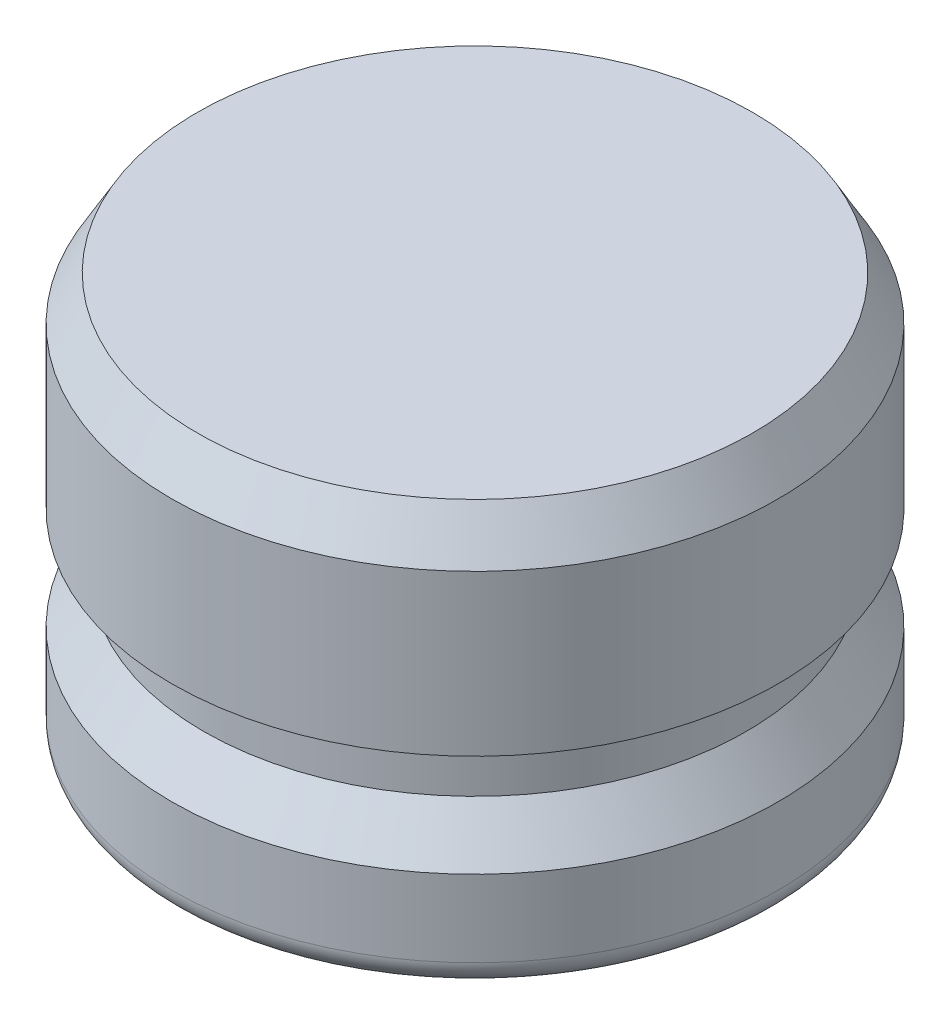
ISO-10303-21;
HEADER;
FILE_DESCRIPTION(('STEP AP214'),'2;1');
FILE_NAME('part.step','',(''),(''),'','','');
FILE_SCHEMA(('AUTOMOTIVE_DESIGN { 1 0 10303 214 1 1 1 1 }'));
ENDSEC;
DATA;
#1=APPLICATION_CONTEXT('core data for automotive mechanical design processes');
#2=APPLICATION_PROTOCOL_DEFINITION('international standard','automotive_design',2000,#1);
#3=PRODUCT_CONTEXT('',#1,'mechanical');
#4=PRODUCT('Part','Part','',(#3));
#5=PRODUCT_RELATED_PRODUCT_CATEGORY('part','',(#4));
#6=PRODUCT_DEFINITION_FORMATION('','',#4);
#7=PRODUCT_DEFINITION_CONTEXT('part definition',#1,'design');
#8=PRODUCT_DEFINITION('design','',#6,#7);
#9=PRODUCT_DEFINITION_SHAPE('','',#8);
#10=(LENGTH_UNIT() NAMED_UNIT(*) SI_UNIT(.MILLI.,.METRE.));
#11=(NAMED_UNIT(*) PLANE_ANGLE_UNIT() SI_UNIT($,.RADIAN.));
#12=(NAMED_UNIT(*) SI_UNIT($,.STERADIAN.) SOLID_ANGLE_UNIT());
#13=UNCERTAINTY_MEASURE_WITH_UNIT(LENGTH_MEASURE(1.E-05),#10,'distance_accuracy_value','');
#14=(GEOMETRIC_REPRESENTATION_CONTEXT(3) GLOBAL_UNCERTAINTY_ASSIGNED_CONTEXT((#13)) GLOBAL_UNIT_ASSIGNED_CONTEXT((#10,
#11,#12)) REPRESENTATION_CONTEXT('',''));
#15=CARTESIAN_POINT('',(0.,0.,0.));
#16=DIRECTION('',(0.,0.,1.));
#17=DIRECTION('',(1.,0.,0.));
#18=AXIS2_PLACEMENT_3D('',#15,#16,#17);
#19=CARTESIAN_POINT('',(0.,0.,0.));
#20=DIRECTION('',(0.,1.,0.));
#21=DIRECTION('',(0.,0.,1.));
#22=AXIS2_PLACEMENT_3D('',#19,#20,#21);
#23=PLANE('',#22);
#24=CARTESIAN_POINT('',(0.,0.,0.));
#25=DIRECTION('',(0.,1.,0.));
#26=DIRECTION('',(0.,0.,1.));
#27=AXIS2_PLACEMENT_3D('',#24,#25,#26);
#28=CIRCLE('',#27,8.62965);
#29=CARTESIAN_POINT('',(0.,0.,8.62965));
#30=VERTEX_POINT('',#29);
#31=EDGE_CURVE('E46',#30,#30,#28,.F.);
#32=ORIENTED_EDGE('',*,*,#31,.T.);
#33=EDGE_LOOP('',(#32));
#34=FACE_BOUND('',#33,.T.);
#35=ADVANCED_FACE('F31',(#34),#23,.F.);
#36=CARTESIAN_POINT('',(0.,0.,0.));
#37=DIRECTION('',(0.,-1.,0.));
#38=DIRECTION('',(0.,0.,-1.));
#39=AXIS2_PLACEMENT_3D('',#36,#37,#38);
#40=CYLINDRICAL_SURFACE('',#39,9.4234);
#41=CARTESIAN_POINT('',(0.,0.793749999999999,0.));
#42=DIRECTION('',(0.,1.,0.));
#43=DIRECTION('',(0.,0.,1.));
#44=AXIS2_PLACEMENT_3D('',#41,#42,#43);
#45=CIRCLE('',#44,9.4234);
#46=CARTESIAN_POINT('',(0.,0.793749999999999,9.4234));
#47=VERTEX_POINT('',#46);
#48=EDGE_CURVE('E42',#47,#47,#45,.T.);
#49=ORIENTED_EDGE('',*,*,#48,.T.);
#50=EDGE_LOOP('',(#49));
#51=FACE_BOUND('',#50,.T.);
#52=CARTESIAN_POINT('',(0.,3.175,0.));
#53=DIRECTION('',(0.,-1.,0.));
#54=DIRECTION('',(0.,0.,-1.));
#55=AXIS2_PLACEMENT_3D('',#52,#53,#54);
#56=CIRCLE('',#55,9.4234);
#57=CARTESIAN_POINT('',(0.,3.175,-9.4234));
#58=VERTEX_POINT('',#57);
#59=EDGE_CURVE('E51',#58,#58,#56,.T.);
#60=ORIENTED_EDGE('',*,*,#59,.T.);
#61=EDGE_LOOP('',(#60));
#62=FACE_BOUND('',#61,.T.);
#63=ADVANCED_FACE('F80',(#51,#62),#40,.T.);
#64=CARTESIAN_POINT('',(0.,4.572,0.));
#65=DIRECTION('',(0.,-1.,0.));
#66=DIRECTION('',(0.,0.,-1.));
#67=AXIS2_PLACEMENT_3D('',#64,#65,#66);
#68=CONICAL_SURFACE('',#67,8.4328,0.616801223788018);
#69=ORIENTED_EDGE('',*,*,#59,.F.);
#70=EDGE_LOOP('',(#69));
#71=FACE_BOUND('',#70,.T.);
#72=CARTESIAN_POINT('',(0.,4.572,0.));
#73=DIRECTION('',(0.,-1.,0.));
#74=DIRECTION('',(0.,0.,-1.));
#75=AXIS2_PLACEMENT_3D('',#72,#73,#74);
#76=CIRCLE('',#75,8.4328);
#77=CARTESIAN_POINT('',(0.,4.572,-8.4328));
#78=VERTEX_POINT('',#77);
#79=EDGE_CURVE('E54',#78,#78,#76,.T.);
#80=ORIENTED_EDGE('',*,*,#79,.T.);
#81=EDGE_LOOP('',(#80));
#82=FACE_BOUND('',#81,.T.);
#83=ADVANCED_FACE('F86',(#71,#82),#68,.T.);
#84=CARTESIAN_POINT('',(0.,0.,0.));
#85=DIRECTION('',(0.,-1.,0.));
#86=DIRECTION('',(0.,0.,-1.));
#87=AXIS2_PLACEMENT_3D('',#84,#85,#86);
#88=CYLINDRICAL_SURFACE('',#87,8.4328);
#89=ORIENTED_EDGE('',*,*,#79,.F.);
#90=EDGE_LOOP('',(#89));
#91=FACE_BOUND('',#90,.T.);
#92=CARTESIAN_POINT('',(0.,6.35,0.));
#93=DIRECTION('',(0.,-1.,0.));
#94=DIRECTION('',(0.,0.,-1.));
#95=AXIS2_PLACEMENT_3D('',#92,#93,#94);
#96=CIRCLE('',#95,8.4328);
#97=CARTESIAN_POINT('',(0.,6.35,-8.4328));
#98=VERTEX_POINT('',#97);
#99=EDGE_CURVE('E57',#98,#98,#96,.T.);
#100=ORIENTED_EDGE('',*,*,#99,.T.);
#101=EDGE_LOOP('',(#100));
#102=FACE_BOUND('',#101,.T.);
#103=ADVANCED_FACE('F76',(#91,#102),#88,.T.);
#104=CARTESIAN_POINT('',(-8.4328,6.35,0.));
#105=DIRECTION('',(0.,1.,0.));
#106=DIRECTION('',(0.,0.,1.));
#107=AXIS2_PLACEMENT_3D('',#104,#105,#106);
#108=PLANE('',#107);
#109=ORIENTED_EDGE('',*,*,#99,.F.);
#110=EDGE_LOOP('',(#109));
#111=FACE_BOUND('',#110,.T.);
#112=CARTESIAN_POINT('',(0.,6.35,0.));
#113=DIRECTION('',(0.,-1.,0.));
#114=DIRECTION('',(0.,0.,-1.));
#115=AXIS2_PLACEMENT_3D('',#112,#113,#114);
#116=CIRCLE('',#115,9.4234);
#117=CARTESIAN_POINT('',(0.,6.35,-9.4234));
#118=VERTEX_POINT('',#117);
#119=EDGE_CURVE('E60',#118,#118,#116,.T.);
#120=ORIENTED_EDGE('',*,*,#119,.T.);
#121=EDGE_LOOP('',(#120));
#122=FACE_BOUND('',#121,.T.);
#123=ADVANCED_FACE('F64',(#111,#122),#108,.F.);
#124=CARTESIAN_POINT('',(0.,0.,0.));
#125=DIRECTION('',(0.,-1.,0.));
#126=DIRECTION('',(0.,0.,-1.));
#127=AXIS2_PLACEMENT_3D('',#124,#125,#126);
#128=CYLINDRICAL_SURFACE('',#127,9.4234);
#129=CARTESIAN_POINT('',(0.,11.3251846714922,0.));
#130=DIRECTION('',(0.,-1.,0.));
#131=DIRECTION('',(0.,0.,-1.));
#132=AXIS2_PLACEMENT_3D('',#129,#130,#131);
#133=CIRCLE('',#132,9.4234);
#134=CARTESIAN_POINT('',(0.,11.3251846714922,-9.4234));
#135=VERTEX_POINT('',#134);
#136=EDGE_CURVE('E38',#135,#135,#133,.T.);
#137=ORIENTED_EDGE('',*,*,#136,.T.);
#138=EDGE_LOOP('',(#137));
#139=FACE_BOUND('',#138,.T.);
#140=ORIENTED_EDGE('',*,*,#119,.F.);
#141=EDGE_LOOP('',(#140));
#142=FACE_BOUND('',#141,.T.);
#143=ADVANCED_FACE('F66',(#139,#142),#128,.T.);
#144=CARTESIAN_POINT('',(-9.4234,12.7,0.));
#145=DIRECTION('',(0.,-1.,0.));
#146=DIRECTION('',(0.,0.,-1.));
#147=AXIS2_PLACEMENT_3D('',#144,#145,#146);
#148=PLANE('',#147);
#149=CARTESIAN_POINT('',(0.,12.7,0.));
#150=DIRECTION('',(0.,-1.,0.));
#151=DIRECTION('',(0.,0.,-1.));
#152=AXIS2_PLACEMENT_3D('',#149,#150,#151);
#153=CIRCLE('',#152,8.62965);
#154=CARTESIAN_POINT('',(0.,12.7,-8.62965));
#155=VERTEX_POINT('',#154);
#156=EDGE_CURVE('E10',#155,#155,#153,.F.);
#157=ORIENTED_EDGE('',*,*,#156,.T.);
#158=EDGE_LOOP('',(#157));
#159=FACE_BOUND('',#158,.T.);
#160=ADVANCED_FACE('F68',(#159),#148,.F.);
#161=CARTESIAN_POINT('',(0.,0.793749999999999,0.));
#162=DIRECTION('',(0.,1.,0.));
#163=DIRECTION('',(0.,0.,1.));
#164=AXIS2_PLACEMENT_3D('',#161,#162,#163);
#165=TOROIDAL_SURFACE('',#164,8.62965,0.79375);
#166=ORIENTED_EDGE('',*,*,#48,.F.);
#167=EDGE_LOOP('',(#166));
#168=FACE_BOUND('',#167,.T.);
#169=ORIENTED_EDGE('',*,*,#31,.F.);
#170=EDGE_LOOP('',(#169));
#171=FACE_BOUND('',#170,.T.);
#172=ADVANCED_FACE('F74',(#168,#171),#165,.T.);
#173=CARTESIAN_POINT('',(0.,11.3251846714922,0.));
#174=DIRECTION('',(0.,-1.,0.));
#175=DIRECTION('',(0.,0.,-1.));
#176=AXIS2_PLACEMENT_3D('',#173,#174,#175);
#177=CONICAL_SURFACE('',#176,9.4234,0.5235987755983);
#178=ORIENTED_EDGE('',*,*,#156,.F.);
#179=EDGE_LOOP('',(#178));
#180=FACE_BOUND('',#179,.T.);
#181=ORIENTED_EDGE('',*,*,#136,.F.);
#182=EDGE_LOOP('',(#181));
#183=FACE_BOUND('',#182,.T.);
#184=ADVANCED_FACE('F33',(#180,#183),#177,.T.);
#185=CLOSED_SHELL('',(#35,#63,#83,#103,#123,#143,#160,#172,#184));
#186=MANIFOLD_SOLID_BREP('B2',#185);
#187=ADVANCED_BREP_SHAPE_REPRESENTATION('',(#18,#186),#14);
#188=SHAPE_DEFINITION_REPRESENTATION(#9,#187);
ENDSEC;
END-ISO-10303-21;
